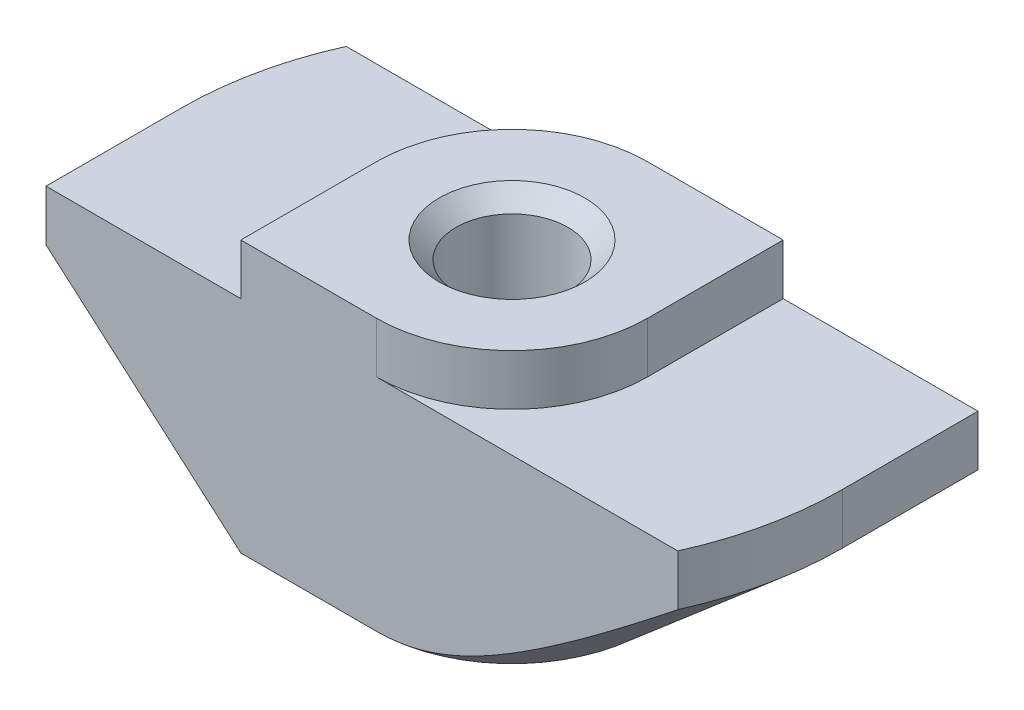
ISO-10303-21;
HEADER;
FILE_DESCRIPTION(('STEP AP214'),'2;1');
FILE_NAME('part.step','',(''),(''),'','','');
FILE_SCHEMA(('AUTOMOTIVE_DESIGN { 1 0 10303 214 1 1 1 1 }'));
ENDSEC;
DATA;
#1=APPLICATION_CONTEXT('core data for automotive mechanical design processes');
#2=APPLICATION_PROTOCOL_DEFINITION('international standard','automotive_design',2000,#1);
#3=PRODUCT_CONTEXT('',#1,'mechanical');
#4=PRODUCT('Part','Part','',(#3));
#5=PRODUCT_RELATED_PRODUCT_CATEGORY('part','',(#4));
#6=PRODUCT_DEFINITION_FORMATION('','',#4);
#7=PRODUCT_DEFINITION_CONTEXT('part definition',#1,'design');
#8=PRODUCT_DEFINITION('design','',#6,#7);
#9=PRODUCT_DEFINITION_SHAPE('','',#8);
#10=(LENGTH_UNIT() NAMED_UNIT(*) SI_UNIT(.MILLI.,.METRE.));
#11=(NAMED_UNIT(*) PLANE_ANGLE_UNIT() SI_UNIT($,.RADIAN.));
#12=(NAMED_UNIT(*) SI_UNIT($,.STERADIAN.) SOLID_ANGLE_UNIT());
#13=UNCERTAINTY_MEASURE_WITH_UNIT(LENGTH_MEASURE(1.E-05),#10,'distance_accuracy_value','');
#14=(GEOMETRIC_REPRESENTATION_CONTEXT(3) GLOBAL_UNCERTAINTY_ASSIGNED_CONTEXT((#13)) GLOBAL_UNIT_ASSIGNED_CONTEXT((#10,
#11,#12)) REPRESENTATION_CONTEXT('',''));
#15=CARTESIAN_POINT('',(0.,0.,0.));
#16=DIRECTION('',(0.,0.,1.));
#17=DIRECTION('',(1.,0.,0.));
#18=AXIS2_PLACEMENT_3D('',#15,#16,#17);
#19=CARTESIAN_POINT('',(-9.75,-1.5,4.));
#20=DIRECTION('',(1.,0.,0.));
#21=DIRECTION('',(0.,0.,-1.));
#22=AXIS2_PLACEMENT_3D('',#19,#20,#21);
#23=PLANE('',#22);
#24=DIRECTION('',(0.,0.,-1.));
#25=VECTOR('',#24,1.);
#26=CARTESIAN_POINT('',(-9.75,-3.,4.));
#27=LINE('',#26,#25);
#28=CARTESIAN_POINT('',(-9.75,-3.,4.));
#29=VERTEX_POINT('',#28);
#30=CARTESIAN_POINT('',(-9.75,-3.,0.));
#31=VERTEX_POINT('',#30);
#32=EDGE_CURVE('E316',#29,#31,#27,.T.);
#33=ORIENTED_EDGE('',*,*,#32,.F.);
#34=DIRECTION('',(0.,-1.,0.));
#35=VECTOR('',#34,1.);
#36=CARTESIAN_POINT('',(-9.75,-1.5,4.));
#37=LINE('',#36,#35);
#38=CARTESIAN_POINT('',(-9.75,-1.5,4.));
#39=VERTEX_POINT('',#38);
#40=EDGE_CURVE('E163',#39,#29,#37,.T.);
#41=ORIENTED_EDGE('',*,*,#40,.F.);
#42=DIRECTION('',(0.,0.,-1.));
#43=VECTOR('',#42,1.);
#44=CARTESIAN_POINT('',(-9.75,-1.5,4.));
#45=LINE('',#44,#43);
#46=CARTESIAN_POINT('',(-9.75,-1.5,0.));
#47=VERTEX_POINT('',#46);
#48=EDGE_CURVE('E45',#39,#47,#45,.T.);
#49=ORIENTED_EDGE('',*,*,#48,.T.);
#50=DIRECTION('',(0.,1.,0.));
#51=VECTOR('',#50,1.);
#52=CARTESIAN_POINT('',(-9.75,-8.,0.));
#53=LINE('',#52,#51);
#54=EDGE_CURVE('E209',#31,#47,#53,.T.);
#55=ORIENTED_EDGE('',*,*,#54,.F.);
#56=EDGE_LOOP('',(#33,#41,#49,#55));
#57=FACE_BOUND('',#56,.T.);
#58=ADVANCED_FACE('F37',(#57),#23,.F.);
#59=CARTESIAN_POINT('',(-9.75,-8.,4.));
#60=DIRECTION('',(0.,1.,0.));
#61=DIRECTION('',(0.,0.,1.));
#62=AXIS2_PLACEMENT_3D('',#59,#60,#61);
#63=PLANE('',#62);
#64=CARTESIAN_POINT('',(0.,-8.,0.));
#65=DIRECTION('',(0.,1.,0.));
#66=DIRECTION('',(0.,0.,1.));
#67=AXIS2_PLACEMENT_3D('',#64,#65,#66);
#68=CIRCLE('',#67,2.15);
#69=CARTESIAN_POINT('',(0.,-8.,2.15));
#70=VERTEX_POINT('',#69);
#71=EDGE_CURVE('E258',#70,#70,#68,.T.);
#72=ORIENTED_EDGE('',*,*,#71,.T.);
#73=EDGE_LOOP('',(#72));
#74=FACE_BOUND('',#73,.T.);
#75=DIRECTION('',(1.,0.,0.));
#76=VECTOR('',#75,1.);
#77=CARTESIAN_POINT('',(-9.75,-8.,4.));
#78=LINE('',#77,#76);
#79=CARTESIAN_POINT('',(-4.,-8.,4.));
#80=VERTEX_POINT('',#79);
#81=CARTESIAN_POINT('',(0.,-8.,4.));
#82=VERTEX_POINT('',#81);
#83=EDGE_CURVE('E161',#80,#82,#78,.T.);
#84=ORIENTED_EDGE('',*,*,#83,.F.);
#85=DIRECTION('',(0.,0.,-1.));
#86=VECTOR('',#85,1.);
#87=CARTESIAN_POINT('',(-4.,-8.,4.));
#88=LINE('',#87,#86);
#89=CARTESIAN_POINT('',(-4.,-8.,0.));
#90=VERTEX_POINT('',#89);
#91=EDGE_CURVE('E146',#80,#90,#88,.T.);
#92=ORIENTED_EDGE('',*,*,#91,.T.);
#93=CARTESIAN_POINT('',(0.,-8.,0.));
#94=DIRECTION('',(0.,-1.,0.));
#95=DIRECTION('',(-1.,0.,0.));
#96=AXIS2_PLACEMENT_3D('',#93,#94,#95);
#97=CIRCLE('',#96,4.);
#98=CARTESIAN_POINT('',(0.,-8.,-4.));
#99=VERTEX_POINT('',#98);
#100=EDGE_CURVE('E317',#90,#99,#97,.T.);
#101=ORIENTED_EDGE('',*,*,#100,.T.);
#102=DIRECTION('',(1.,0.,0.));
#103=VECTOR('',#102,1.);
#104=CARTESIAN_POINT('',(-9.75,-8.,-4.));
#105=LINE('',#104,#103);
#106=CARTESIAN_POINT('',(4.,-8.,-4.));
#107=VERTEX_POINT('',#106);
#108=EDGE_CURVE('E181',#99,#107,#105,.T.);
#109=ORIENTED_EDGE('',*,*,#108,.T.);
#110=DIRECTION('',(0.,0.,1.));
#111=VECTOR('',#110,1.);
#112=CARTESIAN_POINT('',(4.,-8.,-9.75));
#113=LINE('',#112,#111);
#114=CARTESIAN_POINT('',(4.,-8.,0.));
#115=VERTEX_POINT('',#114);
#116=EDGE_CURVE('E52',#107,#115,#113,.T.);
#117=ORIENTED_EDGE('',*,*,#116,.T.);
#118=CARTESIAN_POINT('',(0.,-8.,0.));
#119=DIRECTION('',(0.,-1.,0.));
#120=DIRECTION('',(1.,0.,0.));
#121=AXIS2_PLACEMENT_3D('',#118,#119,#120);
#122=CIRCLE('',#121,4.);
#123=EDGE_CURVE('E167',#115,#82,#122,.T.);
#124=ORIENTED_EDGE('',*,*,#123,.T.);
#125=EDGE_LOOP('',(#84,#92,#101,#109,#117,#124));
#126=FACE_BOUND('',#125,.T.);
#127=ADVANCED_FACE('F166',(#74,#126),#63,.F.);
#128=CARTESIAN_POINT('',(9.75,-1.5,4.));
#129=DIRECTION('',(-1.,0.,0.));
#130=DIRECTION('',(0.,0.,1.));
#131=AXIS2_PLACEMENT_3D('',#128,#129,#130);
#132=PLANE('',#131);
#133=DIRECTION('',(0.,0.,1.));
#134=VECTOR('',#133,1.);
#135=CARTESIAN_POINT('',(9.75,-3.,-9.75));
#136=LINE('',#135,#134);
#137=CARTESIAN_POINT('',(9.75,-3.,-4.));
#138=VERTEX_POINT('',#137);
#139=CARTESIAN_POINT('',(9.75,-3.,0.));
#140=VERTEX_POINT('',#139);
#141=EDGE_CURVE('E304',#138,#140,#136,.T.);
#142=ORIENTED_EDGE('',*,*,#141,.F.);
#143=DIRECTION('',(0.,1.,0.));
#144=VECTOR('',#143,1.);
#145=CARTESIAN_POINT('',(9.75,-1.5,-4.));
#146=LINE('',#145,#144);
#147=CARTESIAN_POINT('',(9.75,-1.5,-4.));
#148=VERTEX_POINT('',#147);
#149=EDGE_CURVE('E185',#138,#148,#146,.T.);
#150=ORIENTED_EDGE('',*,*,#149,.T.);
#151=DIRECTION('',(0.,0.,-1.));
#152=VECTOR('',#151,1.);
#153=CARTESIAN_POINT('',(9.75,-1.5,4.));
#154=LINE('',#153,#152);
#155=CARTESIAN_POINT('',(9.75,-1.5,0.));
#156=VERTEX_POINT('',#155);
#157=EDGE_CURVE('E203',#156,#148,#154,.T.);
#158=ORIENTED_EDGE('',*,*,#157,.F.);
#159=DIRECTION('',(0.,1.,0.));
#160=VECTOR('',#159,1.);
#161=CARTESIAN_POINT('',(9.75,-8.,0.));
#162=LINE('',#161,#160);
#163=EDGE_CURVE('E220',#140,#156,#162,.T.);
#164=ORIENTED_EDGE('',*,*,#163,.F.);
#165=EDGE_LOOP('',(#142,#150,#158,#164));
#166=FACE_BOUND('',#165,.T.);
#167=ADVANCED_FACE('F303',(#166),#132,.F.);
#168=CARTESIAN_POINT('',(0.,0.,4.));
#169=DIRECTION('',(0.,0.,-1.));
#170=DIRECTION('',(-1.,0.,0.));
#171=AXIS2_PLACEMENT_3D('',#168,#169,#170);
#172=PLANE('',#171);
#173=DIRECTION('',(-0.754605522163505,0.656178714924787,0.));
#174=VECTOR('',#173,1.);
#175=CARTESIAN_POINT('',(-4.,-8.,4.));
#176=LINE('',#175,#174);
#177=EDGE_CURVE('E149',#80,#29,#176,.T.);
#178=ORIENTED_EDGE('',*,*,#177,.F.);
#179=ORIENTED_EDGE('',*,*,#83,.T.);
#180=CARTESIAN_POINT('',(19.0930125034409,5.48479531743841,4.));
#181=CARTESIAN_POINT('',(18.5778133169644,5.04634478096504,4.));
#182=CARTESIAN_POINT('',(18.0622729802475,4.60829381291386,4.));
#183=CARTESIAN_POINT('',(17.0302280235104,3.73329525980051,4.));
#184=CARTESIAN_POINT('',(16.5137233725138,3.29634771128181,4.));
#185=CARTESIAN_POINT('',(15.47863444366,2.42315755061796,4.));
#186=CARTESIAN_POINT('',(14.9600481309705,1.98691734873569,4.));
#187=CARTESIAN_POINT('',(13.9212553406501,1.11639739796508,4.));
#188=CARTESIAN_POINT('',(13.401048906075,0.682117597716457,4.));
#189=CARTESIAN_POINT('',(12.3246773818503,-0.21175731208505,4.));
#190=CARTESIAN_POINT('',(11.7683628761931,-0.671172901903966,4.));
#191=CARTESIAN_POINT('',(10.9310662928984,-1.35689819172363,4.));
#192=CARTESIAN_POINT('',(10.6514842055428,-1.58491694423187,4.));
#193=CARTESIAN_POINT('',(10.0911578682021,-2.03952130793857,4.));
#194=CARTESIAN_POINT('',(9.81041362223716,-2.26610692408762,4.));
#195=CARTESIAN_POINT('',(9.24775627916612,-2.71723925573111,4.));
#196=CARTESIAN_POINT('',(8.96584464993702,-2.94178780024051,4.));
#197=CARTESIAN_POINT('',(8.40017784545761,-3.38854835363034,4.));
#198=CARTESIAN_POINT('',(8.11642269007676,-3.61076038762625,4.));
#199=CARTESIAN_POINT('',(7.54655666760194,-4.05206638411712,4.));
#200=CARTESIAN_POINT('',(7.26044612879617,-4.27116076990599,4.));
#201=CARTESIAN_POINT('',(6.68506947716327,-4.70515877749395,4.));
#202=CARTESIAN_POINT('',(6.39580350808307,-4.92006258896335,4.));
#203=CARTESIAN_POINT('',(5.94380391200236,-5.24880354329621,4.));
#204=CARTESIAN_POINT('',(5.7825678290859,-5.3646987592163,4.));
#205=CARTESIAN_POINT('',(5.45852078349081,-5.59427839205067,4.));
#206=CARTESIAN_POINT('',(5.29570978752578,-5.70796276208432,4.));
#207=CARTESIAN_POINT('',(4.96801437116113,-5.93271086070198,4.));
#208=CARTESIAN_POINT('',(4.80312782045187,-6.04377149083704,4.));
#209=CARTESIAN_POINT('',(4.47106545917387,-6.26241638816355,4.));
#210=CARTESIAN_POINT('',(4.3038897228336,-6.37000076769662,4.));
#211=CARTESIAN_POINT('',(3.96779734207744,-6.58006534355457,4.));
#212=CARTESIAN_POINT('',(3.79889805399672,-6.68257318482784,4.));
#213=CARTESIAN_POINT('',(3.45771491043147,-6.88190221849361,4.));
#214=CARTESIAN_POINT('',(3.28543046434657,-6.97872240660534,4.));
#215=CARTESIAN_POINT('',(2.93709738155444,-7.1646860244681,4.));
#216=CARTESIAN_POINT('',(2.76105538763457,-7.25384179412908,4.));
#217=CARTESIAN_POINT('',(2.40427915744407,-7.42212304050504,4.));
#218=CARTESIAN_POINT('',(2.22354728037757,-7.50125344690475,4.));
#219=CARTESIAN_POINT('',(1.87877415331493,-7.6374635749479,4.));
#220=CARTESIAN_POINT('',(1.71533550918919,-7.69605023700292,4.));
#221=CARTESIAN_POINT('',(1.3842626600524,-7.80005250313673,4.));
#222=CARTESIAN_POINT('',(1.21662899480356,-7.84546979231455,4.));
#223=CARTESIAN_POINT('',(0.879640019068342,-7.9196719407948,4.));
#224=CARTESIAN_POINT('',(0.710326071439545,-7.94864036786479,4.));
#225=CARTESIAN_POINT('',(0.369553218503112,-7.9882685957749,4.));
#226=CARTESIAN_POINT('',(0.198094873403108,-7.99893308174377,4.));
#227=CARTESIAN_POINT('',(-0.14622215115853,-8.00092076503876,4.));
#228=CARTESIAN_POINT('',(-0.319081718741123,-7.9920988065105,4.));
#229=CARTESIAN_POINT('',(-0.66279617162969,-7.95570116318786,4.));
#230=CARTESIAN_POINT('',(-0.833650530135947,-7.92812065766392,4.));
#231=CARTESIAN_POINT('',(-1.17380899940443,-7.85620687940474,4.));
#232=CARTESIAN_POINT('',(-1.34307188352269,-7.811682245836,4.));
#233=CARTESIAN_POINT('',(-1.59373756175264,-7.73469658263694,4.));
#234=CARTESIAN_POINT('',(-1.67676247755531,-7.70733179971942,4.));
#235=CARTESIAN_POINT('',(-1.8417517988474,-7.6495708706268,4.));
#236=CARTESIAN_POINT('',(-1.92371622948916,-7.6191747964966,4.));
#237=CARTESIAN_POINT('',(-2.13504326669252,-7.53682619979317,4.));
#238=CARTESIAN_POINT('',(-2.26359986699921,-7.48280578099689,4.));
#239=CARTESIAN_POINT('',(-2.51824420204764,-7.36919866655113,4.));
#240=CARTESIAN_POINT('',(-2.64433129566204,-7.3096105480052,4.));
#241=CARTESIAN_POINT('',(-2.89436868902728,-7.18584959519642,4.));
#242=CARTESIAN_POINT('',(-3.01831691948272,-7.12167259961822,4.));
#243=CARTESIAN_POINT('',(-3.26422266973225,-6.98960098632555,4.));
#244=CARTESIAN_POINT('',(-3.38617997843972,-6.92170597769097,4.));
#245=CARTESIAN_POINT('',(-3.75029646649663,-6.71298185031499,4.));
#246=CARTESIAN_POINT('',(-3.98982159172294,-6.56756033192358,4.));
#247=CARTESIAN_POINT('',(-4.46340938681992,-6.26843578703017,4.));
#248=CARTESIAN_POINT('',(-4.69747464234275,-6.11473679951732,4.));
#249=CARTESIAN_POINT('',(-5.16321438853325,-5.80025182347771,4.));
#250=CARTESIAN_POINT('',(-5.39485991399544,-5.63942310121265,4.));
#251=CARTESIAN_POINT('',(-5.85502306619878,-5.31332270165477,4.));
#252=CARTESIAN_POINT('',(-6.08354037524194,-5.14805057807379,4.));
#253=CARTESIAN_POINT('',(-6.53765735729361,-4.81451787561935,4.));
#254=CARTESIAN_POINT('',(-6.76326204804518,-4.64626411196043,4.));
#255=CARTESIAN_POINT('',(-7.21253368666862,-4.3072099865075,4.));
#256=CARTESIAN_POINT('',(-7.43620070078051,-4.13640971231412,4.));
#257=CARTESIAN_POINT('',(-7.87440605894757,-3.79864870939196,4.));
#258=CARTESIAN_POINT('',(-8.08899613000098,-3.6317549946429,4.));
#259=CARTESIAN_POINT('',(-8.51708866686722,-3.29638802975018,4.));
#260=CARTESIAN_POINT('',(-8.73059061658266,-3.12791412140789,4.));
#261=CARTESIAN_POINT('',(-9.15412189702873,-2.79172022690956,4.));
#262=CARTESIAN_POINT('',(-9.36416259813433,-2.62401455116661,4.));
#263=CARTESIAN_POINT('',(-9.78334542346964,-2.28767615731866,4.));
#264=CARTESIAN_POINT('',(-9.99248790937981,-2.11904389012149,4.));
#265=CARTESIAN_POINT('',(-10.2013028815516,-1.95000895828563,4.));
#266=B_SPLINE_CURVE_WITH_KNOTS('',3,(#180,#181,#182,#183,#184,#185,#186,#187,#188,#189,#190,
#191,#192,#193,#194,#195,#196,#197,#198,#199,#200,#201,#202,#203,#204,#205,#206,#207,#208,#209,
#210,#211,#212,#213,#214,#215,#216,#217,#218,#219,#220,#221,#222,#223,#224,#225,#226,#227,#228,
#229,#230,#231,#232,#233,#234,#235,#236,#237,#238,#239,#240,#241,#242,#243,#244,#245,#246,#247,
#248,#249,#250,#251,#252,#253,#254,#255,#256,#257,#258,#259,#260,#261,#262,#263,#264,#265),
.UNSPECIFIED.,.F.,.F.,(4,2,2,2,2,2,2,2,2,2,2,2,2,2,2,2,2,2,2,2,2,2,2,2,2,2,2,2,2,2,2,2,2,2,2,2,
2,2,2,2,2,2,4),(0.,2.02953833455181,4.05914302502208,6.09215065585671,8.12510471143518,
10.2895570428798,11.371878906685,12.4541970297015,13.535421419087,14.6166341743324,
15.6976987012863,16.7787141838814,17.3744003174641,17.9700990687338,18.5664692951226,
19.1628202293636,19.7554524823498,20.3481890650503,20.9399527193616,21.5314242521027,
22.0518540383534,22.572217203124,23.086652881933,23.6009568646764,24.1191048434135,
24.637386030525,25.1617030827551,25.4239118441335,25.6861143750633,26.1042775249438,
26.5225478355647,26.9412023765355,27.3599010206039,28.2002514013315,29.0401953843998,
29.8861310854953,30.7321520707985,31.576440022776,32.4206989977375,33.236240856672,
34.052139001134,34.8584735236023,35.6644453613211),.UNSPECIFIED.);
#267=CARTESIAN_POINT('',(8.89170962188937,-3.,4.));
#268=VERTEX_POINT('',#267);
#269=EDGE_CURVE('E321',#268,#82,#266,.T.);
#270=ORIENTED_EDGE('',*,*,#269,.F.);
#271=DIRECTION('',(0.,1.,0.));
#272=VECTOR('',#271,1.);
#273=CARTESIAN_POINT('',(8.89170962188937,-8.,4.));
#274=LINE('',#273,#272);
#275=CARTESIAN_POINT('',(8.89170962188937,-1.5,4.));
#276=VERTEX_POINT('',#275);
#277=EDGE_CURVE('E223',#268,#276,#274,.T.);
#278=ORIENTED_EDGE('',*,*,#277,.T.);
#279=DIRECTION('',(-1.,0.,0.));
#280=VECTOR('',#279,1.);
#281=CARTESIAN_POINT('',(4.,-1.5,4.));
#282=LINE('',#281,#280);
#283=CARTESIAN_POINT('',(0.,-1.5,4.));
#284=VERTEX_POINT('',#283);
#285=EDGE_CURVE('E168',#276,#284,#282,.T.);
#286=ORIENTED_EDGE('',*,*,#285,.T.);
#287=DIRECTION('',(0.,1.,0.));
#288=VECTOR('',#287,1.);
#289=CARTESIAN_POINT('',(0.,-7.15685424949238,4.));
#290=LINE('',#289,#288);
#291=CARTESIAN_POINT('',(0.,0.,4.));
#292=VERTEX_POINT('',#291);
#293=EDGE_CURVE('E246',#284,#292,#290,.T.);
#294=ORIENTED_EDGE('',*,*,#293,.T.);
#295=DIRECTION('',(-1.,0.,0.));
#296=VECTOR('',#295,1.);
#297=CARTESIAN_POINT('',(4.,0.,4.));
#298=LINE('',#297,#296);
#299=CARTESIAN_POINT('',(-4.,0.,4.));
#300=VERTEX_POINT('',#299);
#301=EDGE_CURVE('E170',#292,#300,#298,.T.);
#302=ORIENTED_EDGE('',*,*,#301,.T.);
#303=DIRECTION('',(0.,-1.,0.));
#304=VECTOR('',#303,1.);
#305=CARTESIAN_POINT('',(-4.,0.,4.));
#306=LINE('',#305,#304);
#307=CARTESIAN_POINT('',(-4.,-1.5,4.));
#308=VERTEX_POINT('',#307);
#309=EDGE_CURVE('E196',#300,#308,#306,.T.);
#310=ORIENTED_EDGE('',*,*,#309,.T.);
#311=DIRECTION('',(-1.,0.,0.));
#312=VECTOR('',#311,1.);
#313=CARTESIAN_POINT('',(-4.,-1.5,4.));
#314=LINE('',#313,#312);
#315=EDGE_CURVE('E172',#308,#39,#314,.T.);
#316=ORIENTED_EDGE('',*,*,#315,.T.);
#317=ORIENTED_EDGE('',*,*,#40,.T.);
#318=EDGE_LOOP('',(#178,#179,#270,#278,#286,#294,#302,#310,#316,#317));
#319=FACE_BOUND('',#318,.T.);
#320=ADVANCED_FACE('F159',(#319),#172,.F.);
#321=CARTESIAN_POINT('',(0.,0.,-4.));
#322=DIRECTION('',(0.,0.,-1.));
#323=DIRECTION('',(-1.,0.,0.));
#324=AXIS2_PLACEMENT_3D('',#321,#322,#323);
#325=PLANE('',#324);
#326=ORIENTED_EDGE('',*,*,#108,.F.);
#327=CARTESIAN_POINT('',(10.2013028815516,-1.95000895828561,-4.));
#328=CARTESIAN_POINT('',(10.0339198393362,-2.08551143614665,-4.));
#329=CARTESIAN_POINT('',(9.86632283217457,-2.2207499092589,-4.));
#330=CARTESIAN_POINT('',(9.5306291113076,-2.49060788617074,-4.));
#331=CARTESIAN_POINT('',(9.3625323935981,-2.6252273849884,-4.));
#332=CARTESIAN_POINT('',(8.85711014174881,-3.02824011005636,-4.));
#333=CARTESIAN_POINT('',(8.51892952893781,-3.29556281198958,-4.));
#334=CARTESIAN_POINT('',(7.82606328189803,-3.83681323070731,-4.));
#335=CARTESIAN_POINT('',(7.47125417808717,-4.11058357354471,-4.));
#336=CARTESIAN_POINT('',(6.93566544519761,-4.51652980873558,-4.));
#337=CARTESIAN_POINT('',(6.75663624561629,-4.65101435659177,-4.));
#338=CARTESIAN_POINT('',(6.39716787276301,-4.91808381202073,-4.));
#339=CARTESIAN_POINT('',(6.21672871850456,-5.05066874514209,-4.));
#340=CARTESIAN_POINT('',(5.85418369277563,-5.31345193555315,-4.));
#341=CARTESIAN_POINT('',(5.67207823226353,-5.44365075874076,-4.));
#342=CARTESIAN_POINT('',(5.30576731880303,-5.70107997472775,-4.));
#343=CARTESIAN_POINT('',(5.12156180206058,-5.82831027699185,-4.));
#344=CARTESIAN_POINT('',(4.75011127026993,-6.07925940964712,-4.));
#345=CARTESIAN_POINT('',(4.56285994512742,-6.20296893308306,-4.));
#346=CARTESIAN_POINT('',(4.18513224883839,-6.44535805808298,-4.));
#347=CARTESIAN_POINT('',(3.99465611805763,-6.56403803224218,-4.));
#348=CARTESIAN_POINT('',(3.61304128488062,-6.79266272765141,-4.));
#349=CARTESIAN_POINT('',(3.42197306424269,-6.90272431468641,-4.));
#350=CARTESIAN_POINT('',(3.03491286140894,-7.11411820657794,-4.));
#351=CARTESIAN_POINT('',(2.83891889996064,-7.21544692756372,-4.));
#352=CARTESIAN_POINT('',(2.44192184290774,-7.40560938726516,-4.));
#353=CARTESIAN_POINT('',(2.24094385599254,-7.49449488615489,-4.));
#354=CARTESIAN_POINT('',(1.8325063106098,-7.65562668554541,-4.));
#355=CARTESIAN_POINT('',(1.62505480048051,-7.72789278037345,-4.));
#356=CARTESIAN_POINT('',(1.27981814559727,-7.82796451166703,-4.));
#357=CARTESIAN_POINT('',(1.14396110792812,-7.86239848800736,-4.));
#358=CARTESIAN_POINT('',(0.869910445029896,-7.92056970940938,-4.));
#359=CARTESIAN_POINT('',(0.731716453760718,-7.94430526235705,-4.));
#360=CARTESIAN_POINT('',(0.454464556175093,-7.97964173047544,-4.));
#361=CARTESIAN_POINT('',(0.315414459383221,-7.99130291119976,-4.));
#362=CARTESIAN_POINT('',(0.0368276951767137,-8.0019571726022,-4.));
#363=CARTESIAN_POINT('',(-0.102708943731008,-8.00095098340584,-4.));
#364=CARTESIAN_POINT('',(-0.38098249054024,-7.9863455393582,-4.));
#365=CARTESIAN_POINT('',(-0.519720005408902,-7.97275762445244,-4.));
#366=CARTESIAN_POINT('',(-0.795526149407617,-7.93385441309408,-4.));
#367=CARTESIAN_POINT('',(-0.932594595612336,-7.90853784287634,-4.));
#368=CARTESIAN_POINT('',(-1.20518982051904,-7.84736843394937,-4.));
#369=CARTESIAN_POINT('',(-1.34070240327483,-7.81145325217638,-4.));
#370=CARTESIAN_POINT('',(-1.60900813965177,-7.73074156625156,-4.));
#371=CARTESIAN_POINT('',(-1.74180146424736,-7.68594562238459,-4.));
#372=CARTESIAN_POINT('',(-2.06774555470206,-7.56574973434711,-4.));
#373=CARTESIAN_POINT('',(-2.25927747683547,-7.48597990119863,-4.));
#374=CARTESIAN_POINT('',(-2.63698467897033,-7.31453077262157,-4.));
#375=CARTESIAN_POINT('',(-2.82315606434946,-7.22284307246944,-4.));
#376=CARTESIAN_POINT('',(-3.19133344589281,-7.0304609141347,-4.));
#377=CARTESIAN_POINT('',(-3.37332794720551,-6.92974465007832,-4.));
#378=CARTESIAN_POINT('',(-3.7334477915038,-6.72176852295224,-4.));
#379=CARTESIAN_POINT('',(-3.91157408445031,-6.6145102916867,-4.));
#380=CARTESIAN_POINT('',(-4.26690326443273,-6.39365749074014,-4.));
#381=CARTESIAN_POINT('',(-4.444067421961,-6.2800009179053,-4.));
#382=CARTESIAN_POINT('',(-4.79581550110569,-6.0487604594614,-4.));
#383=CARTESIAN_POINT('',(-4.97039930014717,-5.93117638814353,-4.));
#384=CARTESIAN_POINT('',(-5.31718243657692,-5.69312760113897,-4.));
#385=CARTESIAN_POINT('',(-5.48938509058574,-5.57266770382255,-4.));
#386=CARTESIAN_POINT('',(-5.832052772288,-5.32931648933681,-4.));
#387=CARTESIAN_POINT('',(-6.0025178459933,-5.20642523680557,-4.));
#388=CARTESIAN_POINT('',(-6.46417550999881,-4.86955059087449,-4.));
#389=CARTESIAN_POINT('',(-6.75397131864408,-4.6536542948738,-4.));
#390=CARTESIAN_POINT('',(-7.33046309681157,-4.217755036655,-4.));
#391=CARTESIAN_POINT('',(-7.61715893303351,-3.99775189894105,-4.));
#392=CARTESIAN_POINT('',(-8.18823393079153,-3.55468662675595,-4.));
#393=CARTESIAN_POINT('',(-8.47261278287653,-3.33162409401831,-4.));
#394=CARTESIAN_POINT('',(-9.03955595713135,-2.88320266419135,-4.));
#395=CARTESIAN_POINT('',(-9.32212026063873,-2.6578437435454,-4.));
#396=CARTESIAN_POINT('',(-9.886143453162,-2.20508818164028,-4.));
#397=CARTESIAN_POINT('',(-10.1676007023281,-1.97768949943048,-4.));
#398=CARTESIAN_POINT('',(-10.7293691975362,-1.52148028275231,-4.));
#399=CARTESIAN_POINT('',(-11.0096804397628,-1.29266974358973,-4.));
#400=CARTESIAN_POINT('',(-11.8491851542355,-0.604591320533747,-4.));
#401=CARTESIAN_POINT('',(-12.4069971523932,-0.143638301746192,-4.));
#402=CARTESIAN_POINT('',(-13.4777900145884,0.746108447391972,-4.));
#403=CARTESIAN_POINT('',(-13.9909542215763,1.17468201561434,-4.));
#404=CARTESIAN_POINT('',(-15.0157237514183,2.03371405569384,-4.));
#405=CARTESIAN_POINT('',(-15.5273290352433,2.46417257409544,-4.));
#406=CARTESIAN_POINT('',(-16.5484683455278,3.32572688529102,-4.));
#407=CARTESIAN_POINT('',(-17.0580044304759,3.7568202401299,-4.));
#408=CARTESIAN_POINT('',(-18.0761421237496,4.6200775417147,-4.));
#409=CARTESIAN_POINT('',(-18.5847437603499,5.05224145510645,-4.));
#410=CARTESIAN_POINT('',(-19.0930125034409,5.48479531743842,-4.));
#411=B_SPLINE_CURVE_WITH_KNOTS('',3,(#327,#328,#329,#330,#331,#332,#333,#334,#335,#336,#337,
#338,#339,#340,#341,#342,#343,#344,#345,#346,#347,#348,#349,#350,#351,#352,#353,#354,#355,#356,
#357,#358,#359,#360,#361,#362,#363,#364,#365,#366,#367,#368,#369,#370,#371,#372,#373,#374,#375,
#376,#377,#378,#379,#380,#381,#382,#383,#384,#385,#386,#387,#388,#389,#390,#391,#392,#393,#394,
#395,#396,#397,#398,#399,#400,#401,#402,#403,#404,#405,#406,#407,#408,#409,#410),.UNSPECIFIED.,
.F.,.F.,(4,2,2,2,2,2,2,2,2,2,2,2,2,2,2,2,2,2,2,2,2,2,2,2,2,2,2,2,2,2,2,2,2,2,2,2,2,2,2,2,2,4),
(0.,0.646066469562852,1.29213813004586,2.58535159892046,3.92975214476226,4.60148503690557,
5.27320888617807,5.94477130988362,6.6163541884943,7.28957271997509,7.96274129110434,
8.6240786797822,9.28568619424606,9.94445418525195,10.6024334479883,11.0225346289763,
11.442702231889,11.8607624364611,12.2787985448689,12.6964582424969,13.1141633097869,
13.5343761117408,13.9545624110161,14.576405787849,15.1986901050663,15.8225200909053,
16.4461951022656,17.0775908972504,17.709016589694,18.3394497925658,18.9698662577038,
20.0539373371927,21.1380548483351,22.2223148532865,23.3065859919301,24.3921009102971,
25.4776194397949,27.6484733081619,29.6542390606716,31.6600546233868,33.6623558511828,
35.6645954610344),.UNSPECIFIED.);
#412=CARTESIAN_POINT('',(-8.89170962188937,-3.,-4.));
#413=VERTEX_POINT('',#412);
#414=EDGE_CURVE('E227',#99,#413,#411,.T.);
#415=ORIENTED_EDGE('',*,*,#414,.T.);
#416=DIRECTION('',(0.,1.,0.));
#417=VECTOR('',#416,1.);
#418=CARTESIAN_POINT('',(-8.89170962188937,-8.,-4.));
#419=LINE('',#418,#417);
#420=CARTESIAN_POINT('',(-8.89170962188937,-1.5,-4.));
#421=VERTEX_POINT('',#420);
#422=EDGE_CURVE('E219',#413,#421,#419,.T.);
#423=ORIENTED_EDGE('',*,*,#422,.T.);
#424=DIRECTION('',(-1.,0.,0.));
#425=VECTOR('',#424,1.);
#426=CARTESIAN_POINT('',(-4.,-1.5,-4.));
#427=LINE('',#426,#425);
#428=CARTESIAN_POINT('',(0.,-1.5,-4.));
#429=VERTEX_POINT('',#428);
#430=EDGE_CURVE('E178',#429,#421,#427,.T.);
#431=ORIENTED_EDGE('',*,*,#430,.F.);
#432=DIRECTION('',(0.,1.,0.));
#433=VECTOR('',#432,1.);
#434=CARTESIAN_POINT('',(0.,-7.15685424949238,-4.));
#435=LINE('',#434,#433);
#436=CARTESIAN_POINT('',(0.,0.,-4.));
#437=VERTEX_POINT('',#436);
#438=EDGE_CURVE('E255',#429,#437,#435,.T.);
#439=ORIENTED_EDGE('',*,*,#438,.T.);
#440=DIRECTION('',(-1.,0.,0.));
#441=VECTOR('',#440,1.);
#442=CARTESIAN_POINT('',(4.,0.,-4.));
#443=LINE('',#442,#441);
#444=CARTESIAN_POINT('',(4.,0.,-4.));
#445=VERTEX_POINT('',#444);
#446=EDGE_CURVE('E193',#445,#437,#443,.T.);
#447=ORIENTED_EDGE('',*,*,#446,.F.);
#448=DIRECTION('',(0.,1.,0.));
#449=VECTOR('',#448,1.);
#450=CARTESIAN_POINT('',(4.,0.,-4.));
#451=LINE('',#450,#449);
#452=CARTESIAN_POINT('',(4.,-1.5,-4.));
#453=VERTEX_POINT('',#452);
#454=EDGE_CURVE('E190',#453,#445,#451,.T.);
#455=ORIENTED_EDGE('',*,*,#454,.F.);
#456=DIRECTION('',(-1.,0.,0.));
#457=VECTOR('',#456,1.);
#458=CARTESIAN_POINT('',(4.,-1.5,-4.));
#459=LINE('',#458,#457);
#460=EDGE_CURVE('E187',#148,#453,#459,.T.);
#461=ORIENTED_EDGE('',*,*,#460,.F.);
#462=ORIENTED_EDGE('',*,*,#149,.F.);
#463=DIRECTION('',(-0.754605522163505,-0.656178714924787,0.));
#464=VECTOR('',#463,1.);
#465=CARTESIAN_POINT('',(5.68353067814855,-6.53606027987083,-4.));
#466=LINE('',#465,#464);
#467=EDGE_CURVE('E313',#138,#107,#466,.T.);
#468=ORIENTED_EDGE('',*,*,#467,.T.);
#469=EDGE_LOOP('',(#326,#415,#423,#431,#439,#447,#455,#461,#462,#468));
#470=FACE_BOUND('',#469,.T.);
#471=ADVANCED_FACE('F283',(#470),#325,.T.);
#472=CARTESIAN_POINT('',(0.,-8.,0.));
#473=DIRECTION('',(0.,1.,0.));
#474=DIRECTION('',(-1.,0.,0.));
#475=AXIS2_PLACEMENT_3D('',#472,#473,#474);
#476=CYLINDRICAL_SURFACE('',#475,9.75);
#477=CARTESIAN_POINT('',(0.,-3.,0.));
#478=DIRECTION('',(0.,-1.,0.));
#479=DIRECTION('',(-1.,0.,0.));
#480=AXIS2_PLACEMENT_3D('',#477,#478,#479);
#481=CIRCLE('',#480,9.75);
#482=EDGE_CURVE('E60',#31,#413,#481,.T.);
#483=ORIENTED_EDGE('',*,*,#482,.F.);
#484=ORIENTED_EDGE('',*,*,#54,.T.);
#485=CARTESIAN_POINT('',(0.,-1.5,0.));
#486=DIRECTION('',(0.,-1.,0.));
#487=DIRECTION('',(-1.,0.,0.));
#488=AXIS2_PLACEMENT_3D('',#485,#486,#487);
#489=CIRCLE('',#488,9.75);
#490=EDGE_CURVE('E215',#47,#421,#489,.T.);
#491=ORIENTED_EDGE('',*,*,#490,.T.);
#492=ORIENTED_EDGE('',*,*,#422,.F.);
#493=EDGE_LOOP('',(#483,#484,#491,#492));
#494=FACE_BOUND('',#493,.T.);
#495=ADVANCED_FACE('F344',(#494),#476,.T.);
#496=CARTESIAN_POINT('',(0.,-8.,0.));
#497=DIRECTION('',(0.,1.,0.));
#498=DIRECTION('',(-1.,0.,0.));
#499=AXIS2_PLACEMENT_3D('',#496,#497,#498);
#500=CYLINDRICAL_SURFACE('',#499,9.75);
#501=CARTESIAN_POINT('',(0.,-3.,0.));
#502=DIRECTION('',(0.,-1.,0.));
#503=DIRECTION('',(1.,0.,0.));
#504=AXIS2_PLACEMENT_3D('',#501,#502,#503);
#505=CIRCLE('',#504,9.75);
#506=EDGE_CURVE('E309',#140,#268,#505,.T.);
#507=ORIENTED_EDGE('',*,*,#506,.F.);
#508=ORIENTED_EDGE('',*,*,#163,.T.);
#509=CARTESIAN_POINT('',(0.,-1.5,0.));
#510=DIRECTION('',(0.,-1.,0.));
#511=DIRECTION('',(1.,0.,0.));
#512=AXIS2_PLACEMENT_3D('',#509,#510,#511);
#513=CIRCLE('',#512,9.75);
#514=EDGE_CURVE('E237',#156,#276,#513,.T.);
#515=ORIENTED_EDGE('',*,*,#514,.T.);
#516=ORIENTED_EDGE('',*,*,#277,.F.);
#517=EDGE_LOOP('',(#507,#508,#515,#516));
#518=FACE_BOUND('',#517,.T.);
#519=ADVANCED_FACE('F347',(#518),#500,.T.);
#520=CARTESIAN_POINT('',(-4.,0.,4.));
#521=DIRECTION('',(1.,0.,0.));
#522=DIRECTION('',(0.,0.,-1.));
#523=AXIS2_PLACEMENT_3D('',#520,#521,#522);
#524=PLANE('',#523);
#525=DIRECTION('',(0.,0.,-1.));
#526=VECTOR('',#525,1.);
#527=CARTESIAN_POINT('',(-4.,0.,4.));
#528=LINE('',#527,#526);
#529=CARTESIAN_POINT('',(-4.,0.,0.));
#530=VERTEX_POINT('',#529);
#531=EDGE_CURVE('E177',#300,#530,#528,.T.);
#532=ORIENTED_EDGE('',*,*,#531,.T.);
#533=DIRECTION('',(0.,1.,0.));
#534=VECTOR('',#533,1.);
#535=CARTESIAN_POINT('',(-4.,-7.15685424949238,0.));
#536=LINE('',#535,#534);
#537=CARTESIAN_POINT('',(-4.,-1.5,0.));
#538=VERTEX_POINT('',#537);
#539=EDGE_CURVE('E252',#538,#530,#536,.T.);
#540=ORIENTED_EDGE('',*,*,#539,.F.);
#541=DIRECTION('',(0.,0.,-1.));
#542=VECTOR('',#541,1.);
#543=CARTESIAN_POINT('',(-4.,-1.5,4.));
#544=LINE('',#543,#542);
#545=EDGE_CURVE('E11',#308,#538,#544,.T.);
#546=ORIENTED_EDGE('',*,*,#545,.F.);
#547=ORIENTED_EDGE('',*,*,#309,.F.);
#548=EDGE_LOOP('',(#532,#540,#546,#547));
#549=FACE_BOUND('',#548,.T.);
#550=ADVANCED_FACE('F39',(#549),#524,.F.);
#551=CARTESIAN_POINT('',(-4.,-1.5,4.));
#552=DIRECTION('',(0.,-1.,0.));
#553=DIRECTION('',(1.,0.,0.));
#554=AXIS2_PLACEMENT_3D('',#551,#552,#553);
#555=PLANE('',#554);
#556=ORIENTED_EDGE('',*,*,#430,.T.);
#557=ORIENTED_EDGE('',*,*,#490,.F.);
#558=ORIENTED_EDGE('',*,*,#48,.F.);
#559=ORIENTED_EDGE('',*,*,#315,.F.);
#560=ORIENTED_EDGE('',*,*,#545,.T.);
#561=CARTESIAN_POINT('',(0.,-1.5,0.));
#562=DIRECTION('',(0.,-1.,0.));
#563=DIRECTION('',(1.,0.,0.));
#564=AXIS2_PLACEMENT_3D('',#561,#562,#563);
#565=CIRCLE('',#564,4.);
#566=EDGE_CURVE('E253',#538,#429,#565,.T.);
#567=ORIENTED_EDGE('',*,*,#566,.T.);
#568=EDGE_LOOP('',(#556,#557,#558,#559,#560,#567));
#569=FACE_BOUND('',#568,.T.);
#570=ADVANCED_FACE('F212',(#569),#555,.F.);
#571=CARTESIAN_POINT('',(4.,-1.5,4.));
#572=DIRECTION('',(0.,-1.,0.));
#573=DIRECTION('',(1.,0.,0.));
#574=AXIS2_PLACEMENT_3D('',#571,#572,#573);
#575=PLANE('',#574);
#576=ORIENTED_EDGE('',*,*,#285,.F.);
#577=ORIENTED_EDGE('',*,*,#514,.F.);
#578=ORIENTED_EDGE('',*,*,#157,.T.);
#579=ORIENTED_EDGE('',*,*,#460,.T.);
#580=DIRECTION('',(0.,0.,-1.));
#581=VECTOR('',#580,1.);
#582=CARTESIAN_POINT('',(4.,-1.5,4.));
#583=LINE('',#582,#581);
#584=CARTESIAN_POINT('',(4.,-1.5,0.));
#585=VERTEX_POINT('',#584);
#586=EDGE_CURVE('E201',#585,#453,#583,.T.);
#587=ORIENTED_EDGE('',*,*,#586,.F.);
#588=CARTESIAN_POINT('',(0.,-1.5,0.));
#589=DIRECTION('',(0.,-1.,0.));
#590=DIRECTION('',(1.,0.,0.));
#591=AXIS2_PLACEMENT_3D('',#588,#589,#590);
#592=CIRCLE('',#591,4.);
#593=EDGE_CURVE('E243',#585,#284,#592,.T.);
#594=ORIENTED_EDGE('',*,*,#593,.T.);
#595=EDGE_LOOP('',(#576,#577,#578,#579,#587,#594));
#596=FACE_BOUND('',#595,.T.);
#597=ADVANCED_FACE('F297',(#596),#575,.F.);
#598=CARTESIAN_POINT('',(4.,0.,4.));
#599=DIRECTION('',(-1.,0.,0.));
#600=DIRECTION('',(0.,0.,1.));
#601=AXIS2_PLACEMENT_3D('',#598,#599,#600);
#602=PLANE('',#601);
#603=DIRECTION('',(0.,0.,-1.));
#604=VECTOR('',#603,1.);
#605=CARTESIAN_POINT('',(4.,0.,4.));
#606=LINE('',#605,#604);
#607=CARTESIAN_POINT('',(4.,0.,0.));
#608=VERTEX_POINT('',#607);
#609=EDGE_CURVE('E199',#608,#445,#606,.T.);
#610=ORIENTED_EDGE('',*,*,#609,.F.);
#611=DIRECTION('',(0.,1.,0.));
#612=VECTOR('',#611,1.);
#613=CARTESIAN_POINT('',(4.,-7.15685424949238,0.));
#614=LINE('',#613,#612);
#615=EDGE_CURVE('E242',#585,#608,#614,.T.);
#616=ORIENTED_EDGE('',*,*,#615,.F.);
#617=ORIENTED_EDGE('',*,*,#586,.T.);
#618=ORIENTED_EDGE('',*,*,#454,.T.);
#619=EDGE_LOOP('',(#610,#616,#617,#618));
#620=FACE_BOUND('',#619,.T.);
#621=ADVANCED_FACE('F291',(#620),#602,.F.);
#622=CARTESIAN_POINT('',(4.,0.,4.));
#623=DIRECTION('',(0.,-1.,0.));
#624=DIRECTION('',(0.,0.,-1.));
#625=AXIS2_PLACEMENT_3D('',#622,#623,#624);
#626=PLANE('',#625);
#627=CARTESIAN_POINT('',(0.,0.,0.));
#628=DIRECTION('',(0.,1.,0.));
#629=DIRECTION('',(0.,0.,1.));
#630=AXIS2_PLACEMENT_3D('',#627,#628,#629);
#631=CIRCLE('',#630,2.15);
#632=CARTESIAN_POINT('',(0.,0.,2.15));
#633=VERTEX_POINT('',#632);
#634=EDGE_CURVE('E262',#633,#633,#631,.T.);
#635=ORIENTED_EDGE('',*,*,#634,.F.);
#636=EDGE_LOOP('',(#635));
#637=FACE_BOUND('',#636,.T.);
#638=ORIENTED_EDGE('',*,*,#301,.F.);
#639=CARTESIAN_POINT('',(0.,0.,0.));
#640=DIRECTION('',(0.,-1.,0.));
#641=DIRECTION('',(0.,0.,-1.));
#642=AXIS2_PLACEMENT_3D('',#639,#640,#641);
#643=CIRCLE('',#642,4.);
#644=EDGE_CURVE('E235',#608,#292,#643,.T.);
#645=ORIENTED_EDGE('',*,*,#644,.F.);
#646=ORIENTED_EDGE('',*,*,#609,.T.);
#647=ORIENTED_EDGE('',*,*,#446,.T.);
#648=CARTESIAN_POINT('',(0.,0.,0.));
#649=DIRECTION('',(0.,-1.,0.));
#650=DIRECTION('',(0.,0.,-1.));
#651=AXIS2_PLACEMENT_3D('',#648,#649,#650);
#652=CIRCLE('',#651,4.);
#653=EDGE_CURVE('E250',#530,#437,#652,.T.);
#654=ORIENTED_EDGE('',*,*,#653,.F.);
#655=ORIENTED_EDGE('',*,*,#531,.F.);
#656=EDGE_LOOP('',(#638,#645,#646,#647,#654,#655));
#657=FACE_BOUND('',#656,.T.);
#658=ADVANCED_FACE('F286',(#637,#657),#626,.F.);
#659=CARTESIAN_POINT('',(0.,-7.5,0.));
#660=DIRECTION('',(0.,-1.,0.));
#661=DIRECTION('',(0.,0.,-1.));
#662=AXIS2_PLACEMENT_3D('',#659,#660,#661);
#663=CONICAL_SURFACE('',#662,1.65,0.785398163397447);
#664=ORIENTED_EDGE('',*,*,#71,.F.);
#665=EDGE_LOOP('',(#664));
#666=FACE_BOUND('',#665,.T.);
#667=CARTESIAN_POINT('',(0.,-7.5,0.));
#668=DIRECTION('',(0.,1.,0.));
#669=DIRECTION('',(0.,0.,1.));
#670=AXIS2_PLACEMENT_3D('',#667,#668,#669);
#671=CIRCLE('',#670,1.65);
#672=CARTESIAN_POINT('',(0.,-7.5,1.65));
#673=VERTEX_POINT('',#672);
#674=EDGE_CURVE('E182',#673,#673,#671,.T.);
#675=ORIENTED_EDGE('',*,*,#674,.T.);
#676=EDGE_LOOP('',(#675));
#677=FACE_BOUND('',#676,.T.);
#678=ADVANCED_FACE('F362',(#666,#677),#663,.F.);
#679=CARTESIAN_POINT('',(0.,0.,0.));
#680=DIRECTION('',(0.,1.,0.));
#681=DIRECTION('',(0.,0.,1.));
#682=AXIS2_PLACEMENT_3D('',#679,#680,#681);
#683=CYLINDRICAL_SURFACE('',#682,1.65);
#684=ORIENTED_EDGE('',*,*,#674,.F.);
#685=EDGE_LOOP('',(#684));
#686=FACE_BOUND('',#685,.T.);
#687=CARTESIAN_POINT('',(0.,-0.500000000000001,0.));
#688=DIRECTION('',(0.,1.,0.));
#689=DIRECTION('',(0.,0.,1.));
#690=AXIS2_PLACEMENT_3D('',#687,#688,#689);
#691=CIRCLE('',#690,1.65);
#692=CARTESIAN_POINT('',(0.,-0.500000000000001,1.65));
#693=VERTEX_POINT('',#692);
#694=EDGE_CURVE('E265',#693,#693,#691,.T.);
#695=ORIENTED_EDGE('',*,*,#694,.T.);
#696=EDGE_LOOP('',(#695));
#697=FACE_BOUND('',#696,.T.);
#698=ADVANCED_FACE('F359',(#686,#697),#683,.F.);
#699=CARTESIAN_POINT('',(0.,0.,0.));
#700=DIRECTION('',(0.,1.,0.));
#701=DIRECTION('',(0.,0.,1.));
#702=AXIS2_PLACEMENT_3D('',#699,#700,#701);
#703=CONICAL_SURFACE('',#702,2.15,0.785398163397448);
#704=ORIENTED_EDGE('',*,*,#694,.F.);
#705=EDGE_LOOP('',(#704));
#706=FACE_BOUND('',#705,.T.);
#707=ORIENTED_EDGE('',*,*,#634,.T.);
#708=EDGE_LOOP('',(#707));
#709=FACE_BOUND('',#708,.T.);
#710=ADVANCED_FACE('F356',(#706,#709),#703,.F.);
#711=CARTESIAN_POINT('',(0.,-7.15685424949238,0.));
#712=DIRECTION('',(0.,1.,0.));
#713=DIRECTION('',(0.,0.,1.));
#714=AXIS2_PLACEMENT_3D('',#711,#712,#713);
#715=CYLINDRICAL_SURFACE('',#714,4.);
#716=ORIENTED_EDGE('',*,*,#539,.T.);
#717=ORIENTED_EDGE('',*,*,#653,.T.);
#718=ORIENTED_EDGE('',*,*,#438,.F.);
#719=ORIENTED_EDGE('',*,*,#566,.F.);
#720=EDGE_LOOP('',(#716,#717,#718,#719));
#721=FACE_BOUND('',#720,.T.);
#722=ADVANCED_FACE('F278',(#721),#715,.T.);
#723=CARTESIAN_POINT('',(0.,-7.15685424949238,0.));
#724=DIRECTION('',(0.,1.,0.));
#725=DIRECTION('',(0.,0.,1.));
#726=AXIS2_PLACEMENT_3D('',#723,#724,#725);
#727=CYLINDRICAL_SURFACE('',#726,4.);
#728=ORIENTED_EDGE('',*,*,#615,.T.);
#729=ORIENTED_EDGE('',*,*,#644,.T.);
#730=ORIENTED_EDGE('',*,*,#293,.F.);
#731=ORIENTED_EDGE('',*,*,#593,.F.);
#732=EDGE_LOOP('',(#728,#729,#730,#731));
#733=FACE_BOUND('',#732,.T.);
#734=ADVANCED_FACE('F339',(#733),#727,.T.);
#735=CARTESIAN_POINT('',(4.,-8.,-9.75));
#736=DIRECTION('',(0.656178714924787,-0.754605522163505,0.));
#737=DIRECTION('',(0.754605522163505,0.656178714924787,0.));
#738=AXIS2_PLACEMENT_3D('',#735,#736,#737);
#739=PLANE('',#738);
#740=ORIENTED_EDGE('',*,*,#141,.T.);
#741=DIRECTION('',(0.754605522163505,0.656178714924787,0.));
#742=VECTOR('',#741,1.);
#743=CARTESIAN_POINT('',(4.,-8.,0.));
#744=LINE('',#743,#742);
#745=EDGE_CURVE('E306',#115,#140,#744,.T.);
#746=ORIENTED_EDGE('',*,*,#745,.F.);
#747=ORIENTED_EDGE('',*,*,#116,.F.);
#748=ORIENTED_EDGE('',*,*,#467,.F.);
#749=EDGE_LOOP('',(#740,#746,#747,#748));
#750=FACE_BOUND('',#749,.T.);
#751=ADVANCED_FACE('F334',(#750),#739,.T.);
#752=CARTESIAN_POINT('',(0.,-8.,0.));
#753=DIRECTION('',(0.,1.,0.));
#754=DIRECTION('',(0.,0.,1.));
#755=AXIS2_PLACEMENT_3D('',#752,#753,#754);
#756=CONICAL_SURFACE('',#755,4.,0.855052737126016);
#757=ORIENTED_EDGE('',*,*,#269,.T.);
#758=ORIENTED_EDGE('',*,*,#123,.F.);
#759=ORIENTED_EDGE('',*,*,#745,.T.);
#760=ORIENTED_EDGE('',*,*,#506,.T.);
#761=EDGE_LOOP('',(#757,#758,#759,#760));
#762=FACE_BOUND('',#761,.T.);
#763=ADVANCED_FACE('F330',(#762),#756,.T.);
#764=CARTESIAN_POINT('',(-4.,-8.,4.));
#765=DIRECTION('',(-0.656178714924787,-0.754605522163505,0.));
#766=DIRECTION('',(0.754605522163504,-0.656178714924787,0.));
#767=AXIS2_PLACEMENT_3D('',#764,#765,#766);
#768=PLANE('',#767);
#769=ORIENTED_EDGE('',*,*,#32,.T.);
#770=DIRECTION('',(-0.754605522163505,0.656178714924787,0.));
#771=VECTOR('',#770,1.);
#772=CARTESIAN_POINT('',(-4.,-8.,0.));
#773=LINE('',#772,#771);
#774=EDGE_CURVE('E151',#90,#31,#773,.T.);
#775=ORIENTED_EDGE('',*,*,#774,.F.);
#776=ORIENTED_EDGE('',*,*,#91,.F.);
#777=ORIENTED_EDGE('',*,*,#177,.T.);
#778=EDGE_LOOP('',(#769,#775,#776,#777));
#779=FACE_BOUND('',#778,.T.);
#780=ADVANCED_FACE('F148',(#779),#768,.T.);
#781=CARTESIAN_POINT('',(0.,-8.,0.));
#782=DIRECTION('',(0.,1.,0.));
#783=DIRECTION('',(0.,0.,1.));
#784=AXIS2_PLACEMENT_3D('',#781,#782,#783);
#785=CONICAL_SURFACE('',#784,4.,0.855052737126016);
#786=ORIENTED_EDGE('',*,*,#100,.F.);
#787=ORIENTED_EDGE('',*,*,#774,.T.);
#788=ORIENTED_EDGE('',*,*,#482,.T.);
#789=ORIENTED_EDGE('',*,*,#414,.F.);
#790=EDGE_LOOP('',(#786,#787,#788,#789));
#791=FACE_BOUND('',#790,.T.);
#792=ADVANCED_FACE('F336',(#791),#785,.T.);
#793=CLOSED_SHELL('',(#58,#127,#167,#320,#471,#495,#519,#550,#570,#597,#621,#658,#678,#698,#710,
#722,#734,#751,#763,#780,#792));
#794=MANIFOLD_SOLID_BREP('B2',#793);
#795=ADVANCED_BREP_SHAPE_REPRESENTATION('',(#18,#794),#14);
#796=SHAPE_DEFINITION_REPRESENTATION(#9,#795);
ENDSEC;
END-ISO-10303-21;
